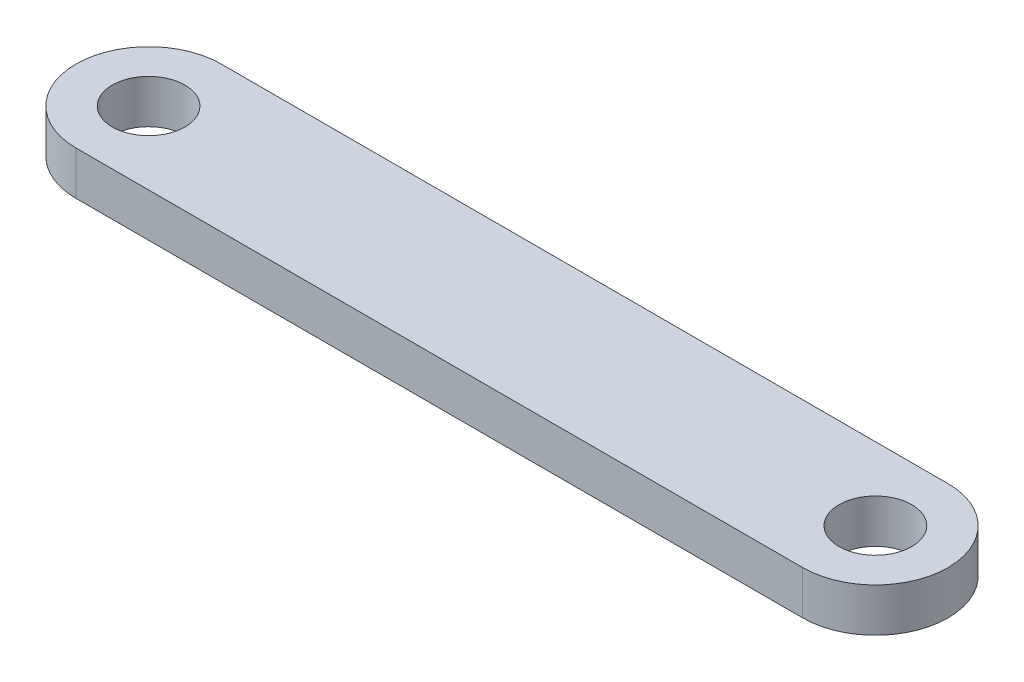
ISO-10303-21;
HEADER;
FILE_DESCRIPTION(('STEP AP214'),'2;1');
FILE_NAME('part.step','',(''),(''),'','','');
FILE_SCHEMA(('AUTOMOTIVE_DESIGN { 1 0 10303 214 1 1 1 1 }'));
ENDSEC;
DATA;
#1=APPLICATION_CONTEXT('core data for automotive mechanical design processes');
#2=APPLICATION_PROTOCOL_DEFINITION('international standard','automotive_design',2000,#1);
#3=PRODUCT_CONTEXT('',#1,'mechanical');
#4=PRODUCT('Part','Part','',(#3));
#5=PRODUCT_RELATED_PRODUCT_CATEGORY('part','',(#4));
#6=PRODUCT_DEFINITION_FORMATION('','',#4);
#7=PRODUCT_DEFINITION_CONTEXT('part definition',#1,'design');
#8=PRODUCT_DEFINITION('design','',#6,#7);
#9=PRODUCT_DEFINITION_SHAPE('','',#8);
#10=(LENGTH_UNIT() NAMED_UNIT(*) SI_UNIT(.MILLI.,.METRE.));
#11=(NAMED_UNIT(*) PLANE_ANGLE_UNIT() SI_UNIT($,.RADIAN.));
#12=(NAMED_UNIT(*) SI_UNIT($,.STERADIAN.) SOLID_ANGLE_UNIT());
#13=UNCERTAINTY_MEASURE_WITH_UNIT(LENGTH_MEASURE(1.E-05),#10,'distance_accuracy_value','');
#14=(GEOMETRIC_REPRESENTATION_CONTEXT(3) GLOBAL_UNCERTAINTY_ASSIGNED_CONTEXT((#13)) GLOBAL_UNIT_ASSIGNED_CONTEXT((#10,
#11,#12)) REPRESENTATION_CONTEXT('',''));
#15=CARTESIAN_POINT('',(0.,0.,0.));
#16=DIRECTION('',(0.,0.,1.));
#17=DIRECTION('',(1.,0.,0.));
#18=AXIS2_PLACEMENT_3D('',#15,#16,#17);
#19=CARTESIAN_POINT('',(-25.,3.,0.));
#20=DIRECTION('',(0.,1.,0.));
#21=DIRECTION('',(0.,0.,1.));
#22=AXIS2_PLACEMENT_3D('',#19,#20,#21);
#23=PLANE('',#22);
#24=CARTESIAN_POINT('',(-25.,3.,0.));
#25=DIRECTION('',(0.,1.,0.));
#26=DIRECTION('',(0.,0.,1.));
#27=AXIS2_PLACEMENT_3D('',#24,#25,#26);
#28=CIRCLE('',#27,2.5);
#29=CARTESIAN_POINT('',(-25.,3.,2.5));
#30=VERTEX_POINT('',#29);
#31=EDGE_CURVE('E100',#30,#30,#28,.T.);
#32=ORIENTED_EDGE('',*,*,#31,.F.);
#33=EDGE_LOOP('',(#32));
#34=FACE_BOUND('',#33,.T.);
#35=CARTESIAN_POINT('',(-25.,3.,0.));
#36=DIRECTION('',(0.,1.,0.));
#37=DIRECTION('',(0.,0.,1.));
#38=AXIS2_PLACEMENT_3D('',#35,#36,#37);
#39=CIRCLE('',#38,5.);
#40=CARTESIAN_POINT('',(-25.,3.,-5.));
#41=VERTEX_POINT('',#40);
#42=CARTESIAN_POINT('',(-25.,3.,5.));
#43=VERTEX_POINT('',#42);
#44=EDGE_CURVE('E85',#41,#43,#39,.T.);
#45=ORIENTED_EDGE('',*,*,#44,.T.);
#46=DIRECTION('',(1.,0.,0.));
#47=VECTOR('',#46,1.);
#48=CARTESIAN_POINT('',(-25.,3.,5.));
#49=LINE('',#48,#47);
#50=CARTESIAN_POINT('',(25.,3.,4.99999999999999));
#51=VERTEX_POINT('',#50);
#52=EDGE_CURVE('E80',#43,#51,#49,.T.);
#53=ORIENTED_EDGE('',*,*,#52,.T.);
#54=CARTESIAN_POINT('',(25.,3.,0.));
#55=DIRECTION('',(0.,1.,0.));
#56=DIRECTION('',(0.,0.,1.));
#57=AXIS2_PLACEMENT_3D('',#54,#55,#56);
#58=CIRCLE('',#57,5.);
#59=CARTESIAN_POINT('',(25.,3.,-5.00000000000001));
#60=VERTEX_POINT('',#59);
#61=EDGE_CURVE('E83',#51,#60,#58,.T.);
#62=ORIENTED_EDGE('',*,*,#61,.T.);
#63=DIRECTION('',(-1.,0.,0.));
#64=VECTOR('',#63,1.);
#65=CARTESIAN_POINT('',(-25.,3.,-5.));
#66=LINE('',#65,#64);
#67=EDGE_CURVE('E50',#60,#41,#66,.T.);
#68=ORIENTED_EDGE('',*,*,#67,.T.);
#69=EDGE_LOOP('',(#45,#53,#62,#68));
#70=FACE_BOUND('',#69,.T.);
#71=CARTESIAN_POINT('',(25.,3.,0.));
#72=DIRECTION('',(0.,1.,0.));
#73=DIRECTION('',(0.,0.,1.));
#74=AXIS2_PLACEMENT_3D('',#71,#72,#73);
#75=CIRCLE('',#74,2.5);
#76=CARTESIAN_POINT('',(25.,3.,2.49999999999999));
#77=VERTEX_POINT('',#76);
#78=EDGE_CURVE('E115',#77,#77,#75,.T.);
#79=ORIENTED_EDGE('',*,*,#78,.F.);
#80=EDGE_LOOP('',(#79));
#81=FACE_BOUND('',#80,.T.);
#82=ADVANCED_FACE('F33',(#34,#70,#81),#23,.T.);
#83=CARTESIAN_POINT('',(-25.,0.,0.));
#84=DIRECTION('',(0.,1.,0.));
#85=DIRECTION('',(0.,0.,1.));
#86=AXIS2_PLACEMENT_3D('',#83,#84,#85);
#87=PLANE('',#86);
#88=CARTESIAN_POINT('',(-25.,0.,0.));
#89=DIRECTION('',(0.,1.,0.));
#90=DIRECTION('',(0.,0.,1.));
#91=AXIS2_PLACEMENT_3D('',#88,#89,#90);
#92=CIRCLE('',#91,2.5);
#93=CARTESIAN_POINT('',(-25.,0.,2.5));
#94=VERTEX_POINT('',#93);
#95=EDGE_CURVE('E112',#94,#94,#92,.T.);
#96=ORIENTED_EDGE('',*,*,#95,.T.);
#97=EDGE_LOOP('',(#96));
#98=FACE_BOUND('',#97,.T.);
#99=CARTESIAN_POINT('',(-25.,0.,0.));
#100=DIRECTION('',(0.,1.,0.));
#101=DIRECTION('',(0.,0.,1.));
#102=AXIS2_PLACEMENT_3D('',#99,#100,#101);
#103=CIRCLE('',#102,5.);
#104=CARTESIAN_POINT('',(-25.,0.,-5.));
#105=VERTEX_POINT('',#104);
#106=CARTESIAN_POINT('',(-25.,0.,5.));
#107=VERTEX_POINT('',#106);
#108=EDGE_CURVE('E97',#105,#107,#103,.T.);
#109=ORIENTED_EDGE('',*,*,#108,.F.);
#110=DIRECTION('',(-1.,0.,0.));
#111=VECTOR('',#110,1.);
#112=CARTESIAN_POINT('',(-25.,0.,-5.));
#113=LINE('',#112,#111);
#114=CARTESIAN_POINT('',(25.,0.,-5.00000000000001));
#115=VERTEX_POINT('',#114);
#116=EDGE_CURVE('E73',#115,#105,#113,.T.);
#117=ORIENTED_EDGE('',*,*,#116,.F.);
#118=CARTESIAN_POINT('',(25.,0.,0.));
#119=DIRECTION('',(0.,1.,0.));
#120=DIRECTION('',(0.,0.,1.));
#121=AXIS2_PLACEMENT_3D('',#118,#119,#120);
#122=CIRCLE('',#121,5.);
#123=CARTESIAN_POINT('',(25.,0.,4.99999999999999));
#124=VERTEX_POINT('',#123);
#125=EDGE_CURVE('E67',#124,#115,#122,.T.);
#126=ORIENTED_EDGE('',*,*,#125,.F.);
#127=DIRECTION('',(1.,0.,0.));
#128=VECTOR('',#127,1.);
#129=CARTESIAN_POINT('',(-25.,0.,5.));
#130=LINE('',#129,#128);
#131=EDGE_CURVE('E89',#107,#124,#130,.T.);
#132=ORIENTED_EDGE('',*,*,#131,.F.);
#133=EDGE_LOOP('',(#109,#117,#126,#132));
#134=FACE_BOUND('',#133,.T.);
#135=CARTESIAN_POINT('',(25.,0.,0.));
#136=DIRECTION('',(0.,1.,0.));
#137=DIRECTION('',(0.,0.,1.));
#138=AXIS2_PLACEMENT_3D('',#135,#136,#137);
#139=CIRCLE('',#138,2.5);
#140=CARTESIAN_POINT('',(25.,0.,2.49999999999999));
#141=VERTEX_POINT('',#140);
#142=EDGE_CURVE('E118',#141,#141,#139,.T.);
#143=ORIENTED_EDGE('',*,*,#142,.T.);
#144=EDGE_LOOP('',(#143));
#145=FACE_BOUND('',#144,.T.);
#146=ADVANCED_FACE('F108',(#98,#134,#145),#87,.F.);
#147=CARTESIAN_POINT('',(-25.,3.,0.));
#148=DIRECTION('',(0.,-1.,0.));
#149=DIRECTION('',(0.,0.,-1.));
#150=AXIS2_PLACEMENT_3D('',#147,#148,#149);
#151=CYLINDRICAL_SURFACE('',#150,5.);
#152=ORIENTED_EDGE('',*,*,#108,.T.);
#153=DIRECTION('',(0.,-1.,0.));
#154=VECTOR('',#153,1.);
#155=CARTESIAN_POINT('',(-25.,3.,5.));
#156=LINE('',#155,#154);
#157=EDGE_CURVE('E11',#43,#107,#156,.T.);
#158=ORIENTED_EDGE('',*,*,#157,.F.);
#159=ORIENTED_EDGE('',*,*,#44,.F.);
#160=DIRECTION('',(0.,-1.,0.));
#161=VECTOR('',#160,1.);
#162=CARTESIAN_POINT('',(-25.,3.,-5.));
#163=LINE('',#162,#161);
#164=EDGE_CURVE('E93',#41,#105,#163,.T.);
#165=ORIENTED_EDGE('',*,*,#164,.T.);
#166=EDGE_LOOP('',(#152,#158,#159,#165));
#167=FACE_BOUND('',#166,.T.);
#168=ADVANCED_FACE('F35',(#167),#151,.T.);
#169=CARTESIAN_POINT('',(-25.,3.,5.));
#170=DIRECTION('',(0.,0.,-1.));
#171=DIRECTION('',(-1.,0.,0.));
#172=AXIS2_PLACEMENT_3D('',#169,#170,#171);
#173=PLANE('',#172);
#174=ORIENTED_EDGE('',*,*,#131,.T.);
#175=DIRECTION('',(0.,-1.,0.));
#176=VECTOR('',#175,1.);
#177=CARTESIAN_POINT('',(25.,3.,4.99999999999999));
#178=LINE('',#177,#176);
#179=EDGE_CURVE('E42',#51,#124,#178,.T.);
#180=ORIENTED_EDGE('',*,*,#179,.F.);
#181=ORIENTED_EDGE('',*,*,#52,.F.);
#182=ORIENTED_EDGE('',*,*,#157,.T.);
#183=EDGE_LOOP('',(#174,#180,#181,#182));
#184=FACE_BOUND('',#183,.T.);
#185=ADVANCED_FACE('F88',(#184),#173,.F.);
#186=CARTESIAN_POINT('',(25.,3.,0.));
#187=DIRECTION('',(0.,-1.,0.));
#188=DIRECTION('',(0.,0.,-1.));
#189=AXIS2_PLACEMENT_3D('',#186,#187,#188);
#190=CYLINDRICAL_SURFACE('',#189,5.);
#191=ORIENTED_EDGE('',*,*,#125,.T.);
#192=DIRECTION('',(0.,-1.,0.));
#193=VECTOR('',#192,1.);
#194=CARTESIAN_POINT('',(25.,3.,-5.00000000000001));
#195=LINE('',#194,#193);
#196=EDGE_CURVE('E90',#60,#115,#195,.T.);
#197=ORIENTED_EDGE('',*,*,#196,.F.);
#198=ORIENTED_EDGE('',*,*,#61,.F.);
#199=ORIENTED_EDGE('',*,*,#179,.T.);
#200=EDGE_LOOP('',(#191,#197,#198,#199));
#201=FACE_BOUND('',#200,.T.);
#202=ADVANCED_FACE('F91',(#201),#190,.T.);
#203=CARTESIAN_POINT('',(-25.,3.,-5.));
#204=DIRECTION('',(0.,0.,1.));
#205=DIRECTION('',(1.,0.,0.));
#206=AXIS2_PLACEMENT_3D('',#203,#204,#205);
#207=PLANE('',#206);
#208=ORIENTED_EDGE('',*,*,#116,.T.);
#209=ORIENTED_EDGE('',*,*,#164,.F.);
#210=ORIENTED_EDGE('',*,*,#67,.F.);
#211=ORIENTED_EDGE('',*,*,#196,.T.);
#212=EDGE_LOOP('',(#208,#209,#210,#211));
#213=FACE_BOUND('',#212,.T.);
#214=ADVANCED_FACE('F105',(#213),#207,.F.);
#215=CARTESIAN_POINT('',(-25.,3.,0.));
#216=DIRECTION('',(0.,-1.,0.));
#217=DIRECTION('',(0.,0.,-1.));
#218=AXIS2_PLACEMENT_3D('',#215,#216,#217);
#219=CYLINDRICAL_SURFACE('',#218,2.5);
#220=ORIENTED_EDGE('',*,*,#31,.T.);
#221=EDGE_LOOP('',(#220));
#222=FACE_BOUND('',#221,.T.);
#223=ORIENTED_EDGE('',*,*,#95,.F.);
#224=EDGE_LOOP('',(#223));
#225=FACE_BOUND('',#224,.T.);
#226=ADVANCED_FACE('F136',(#222,#225),#219,.F.);
#227=CARTESIAN_POINT('',(25.,3.,0.));
#228=DIRECTION('',(0.,-1.,0.));
#229=DIRECTION('',(0.,0.,-1.));
#230=AXIS2_PLACEMENT_3D('',#227,#228,#229);
#231=CYLINDRICAL_SURFACE('',#230,2.5);
#232=ORIENTED_EDGE('',*,*,#78,.T.);
#233=EDGE_LOOP('',(#232));
#234=FACE_BOUND('',#233,.T.);
#235=ORIENTED_EDGE('',*,*,#142,.F.);
#236=EDGE_LOOP('',(#235));
#237=FACE_BOUND('',#236,.T.);
#238=ADVANCED_FACE('F124',(#234,#237),#231,.F.);
#239=CLOSED_SHELL('',(#82,#146,#168,#185,#202,#214,#226,#238));
#240=MANIFOLD_SOLID_BREP('B2',#239);
#241=ADVANCED_BREP_SHAPE_REPRESENTATION('',(#18,#240),#14);
#242=SHAPE_DEFINITION_REPRESENTATION(#9,#241);
ENDSEC;
END-ISO-10303-21;
